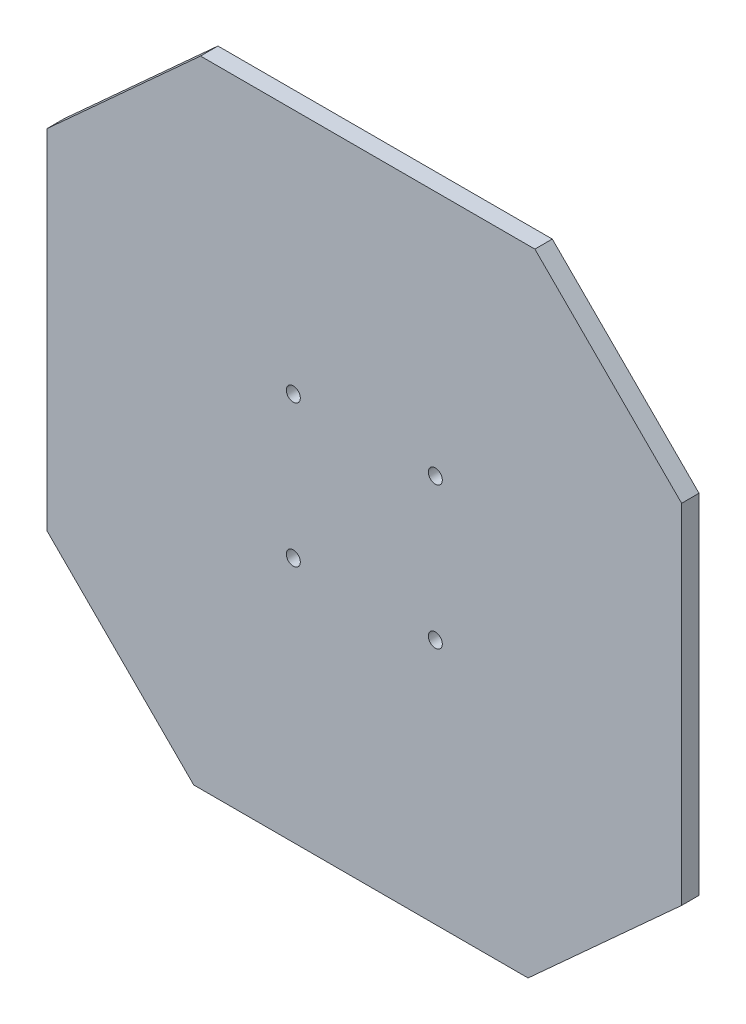
ISO-10303-21;
HEADER;
FILE_DESCRIPTION(('STEP AP214'),'2;1');
FILE_NAME('part.step','',(''),(''),'','','');
FILE_SCHEMA(('AUTOMOTIVE_DESIGN { 1 0 10303 214 1 1 1 1 }'));
ENDSEC;
DATA;
#1=APPLICATION_CONTEXT('core data for automotive mechanical design processes');
#2=APPLICATION_PROTOCOL_DEFINITION('international standard','automotive_design',2000,#1);
#3=PRODUCT_CONTEXT('',#1,'mechanical');
#4=PRODUCT('Part','Part','',(#3));
#5=PRODUCT_RELATED_PRODUCT_CATEGORY('part','',(#4));
#6=PRODUCT_DEFINITION_FORMATION('','',#4);
#7=PRODUCT_DEFINITION_CONTEXT('part definition',#1,'design');
#8=PRODUCT_DEFINITION('design','',#6,#7);
#9=PRODUCT_DEFINITION_SHAPE('','',#8);
#10=(LENGTH_UNIT() NAMED_UNIT(*) SI_UNIT(.MILLI.,.METRE.));
#11=(NAMED_UNIT(*) PLANE_ANGLE_UNIT() SI_UNIT($,.RADIAN.));
#12=(NAMED_UNIT(*) SI_UNIT($,.STERADIAN.) SOLID_ANGLE_UNIT());
#13=UNCERTAINTY_MEASURE_WITH_UNIT(LENGTH_MEASURE(1.E-05),#10,'distance_accuracy_value','');
#14=(GEOMETRIC_REPRESENTATION_CONTEXT(3) GLOBAL_UNCERTAINTY_ASSIGNED_CONTEXT((#13)) GLOBAL_UNIT_ASSIGNED_CONTEXT((#10,
#11,#12)) REPRESENTATION_CONTEXT('',''));
#15=CARTESIAN_POINT('',(0.,0.,0.));
#16=DIRECTION('',(0.,0.,1.));
#17=DIRECTION('',(1.,0.,0.));
#18=AXIS2_PLACEMENT_3D('',#15,#16,#17);
#19=CARTESIAN_POINT('',(92.5410924300891,94.689954591206,2.6));
#20=DIRECTION('',(0.,0.,1.));
#21=DIRECTION('',(1.,0.,0.));
#22=AXIS2_PLACEMENT_3D('',#19,#20,#21);
#23=PLANE('',#22);
#24=CARTESIAN_POINT('',(55.7476941478874,57.8965563090043,2.6));
#25=DIRECTION('',(0.,0.,1.));
#26=DIRECTION('',(1.,0.,0.));
#27=AXIS2_PLACEMENT_3D('',#24,#25,#26);
#28=CIRCLE('',#27,1.05);
#29=CARTESIAN_POINT('',(56.7976941478874,57.8965563090043,2.6));
#30=VERTEX_POINT('',#29);
#31=EDGE_CURVE('E163',#30,#30,#28,.F.);
#32=ORIENTED_EDGE('',*,*,#31,.T.);
#33=EDGE_LOOP('',(#32));
#34=FACE_BOUND('',#33,.T.);
#35=CARTESIAN_POINT('',(34.5344907122909,57.8965563090043,2.6));
#36=DIRECTION('',(0.,0.,1.));
#37=DIRECTION('',(1.,0.,0.));
#38=AXIS2_PLACEMENT_3D('',#35,#36,#37);
#39=CIRCLE('',#38,1.05);
#40=CARTESIAN_POINT('',(35.584490712291,57.8965563090043,2.6));
#41=VERTEX_POINT('',#40);
#42=EDGE_CURVE('E134',#41,#41,#39,.F.);
#43=ORIENTED_EDGE('',*,*,#42,.T.);
#44=EDGE_LOOP('',(#43));
#45=FACE_BOUND('',#44,.T.);
#46=DIRECTION('',(-1.,0.,0.));
#47=VECTOR('',#46,1.);
#48=CARTESIAN_POINT('',(20.6786729232044,94.689954591206,2.6));
#49=LINE('',#48,#47);
#50=CARTESIAN_POINT('',(70.6207822133062,94.689954591206,2.6));
#51=VERTEX_POINT('',#50);
#52=CARTESIAN_POINT('',(20.6786729232044,94.689954591206,2.6));
#53=VERTEX_POINT('',#52);
#54=EDGE_CURVE('E145',#51,#53,#49,.T.);
#55=ORIENTED_EDGE('',*,*,#54,.T.);
#56=DIRECTION('',(-0.739921951390814,-0.672692727662497,0.));
#57=VECTOR('',#56,1.);
#58=CARTESIAN_POINT('',(20.6786729232044,94.689954591206,2.6));
#59=LINE('',#58,#57);
#60=CARTESIAN_POINT('',(-2.25890756991086,73.8364800336686,2.6));
#61=VERTEX_POINT('',#60);
#62=EDGE_CURVE('E93',#53,#61,#59,.T.);
#63=ORIENTED_EDGE('',*,*,#62,.T.);
#64=DIRECTION('',(0.,-1.,0.));
#65=VECTOR('',#64,1.);
#66=CARTESIAN_POINT('',(-2.25890756991086,21.810264807989,2.6));
#67=LINE('',#66,#65);
#68=CARTESIAN_POINT('',(-2.25890756991086,21.810264807989,2.6));
#69=VERTEX_POINT('',#68);
#70=EDGE_CURVE('E183',#61,#69,#67,.T.);
#71=ORIENTED_EDGE('',*,*,#70,.T.);
#72=DIRECTION('',(0.707106781186548,-0.707106781186548,0.));
#73=VECTOR('',#72,1.);
#74=CARTESIAN_POINT('',(-2.25890756991086,21.810264807989,2.6));
#75=LINE('',#74,#73);
#76=CARTESIAN_POINT('',(19.6614026468721,-0.11004540879396,2.6));
#77=VERTEX_POINT('',#76);
#78=EDGE_CURVE('E185',#69,#77,#75,.T.);
#79=ORIENTED_EDGE('',*,*,#78,.T.);
#80=DIRECTION('',(1.,0.,0.));
#81=VECTOR('',#80,1.);
#82=CARTESIAN_POINT('',(19.6614026468721,-0.11004540879396,2.6));
#83=LINE('',#82,#81);
#84=CARTESIAN_POINT('',(69.6035119369739,-0.110045408793957,2.6));
#85=VERTEX_POINT('',#84);
#86=EDGE_CURVE('E112',#77,#85,#83,.T.);
#87=ORIENTED_EDGE('',*,*,#86,.T.);
#88=DIRECTION('',(0.739921951390814,0.672692727662497,0.));
#89=VECTOR('',#88,1.);
#90=CARTESIAN_POINT('',(92.5410924300891,20.7434291487435,2.6));
#91=LINE('',#90,#89);
#92=CARTESIAN_POINT('',(92.5410924300891,20.7434291487435,2.6));
#93=VERTEX_POINT('',#92);
#94=EDGE_CURVE('E106',#85,#93,#91,.T.);
#95=ORIENTED_EDGE('',*,*,#94,.T.);
#96=DIRECTION('',(0.,1.,0.));
#97=VECTOR('',#96,1.);
#98=CARTESIAN_POINT('',(92.5410924300891,20.7434291487435,2.6));
#99=LINE('',#98,#97);
#100=CARTESIAN_POINT('',(92.5410924300891,72.7696443744231,2.6));
#101=VERTEX_POINT('',#100);
#102=EDGE_CURVE('E110',#93,#101,#99,.T.);
#103=ORIENTED_EDGE('',*,*,#102,.T.);
#104=DIRECTION('',(-0.707106781186548,0.707106781186548,0.));
#105=VECTOR('',#104,1.);
#106=CARTESIAN_POINT('',(70.6207822133062,94.689954591206,2.6));
#107=LINE('',#106,#105);
#108=EDGE_CURVE('E50',#101,#51,#107,.T.);
#109=ORIENTED_EDGE('',*,*,#108,.T.);
#110=EDGE_LOOP('',(#55,#63,#71,#79,#87,#95,#103,#109));
#111=FACE_BOUND('',#110,.T.);
#112=CARTESIAN_POINT('',(34.5344907122909,36.6833528734078,2.6));
#113=DIRECTION('',(0.,0.,1.));
#114=DIRECTION('',(1.,0.,0.));
#115=AXIS2_PLACEMENT_3D('',#112,#113,#114);
#116=CIRCLE('',#115,1.05);
#117=CARTESIAN_POINT('',(35.584490712291,36.6833528734078,2.6));
#118=VERTEX_POINT('',#117);
#119=EDGE_CURVE('E160',#118,#118,#116,.F.);
#120=ORIENTED_EDGE('',*,*,#119,.T.);
#121=EDGE_LOOP('',(#120));
#122=FACE_BOUND('',#121,.T.);
#123=CARTESIAN_POINT('',(55.7476941478874,36.6833528734079,2.6));
#124=DIRECTION('',(0.,0.,1.));
#125=DIRECTION('',(1.,0.,0.));
#126=AXIS2_PLACEMENT_3D('',#123,#124,#125);
#127=CIRCLE('',#126,1.05);
#128=CARTESIAN_POINT('',(56.7976941478874,36.6833528734079,2.6));
#129=VERTEX_POINT('',#128);
#130=EDGE_CURVE('E166',#129,#129,#127,.F.);
#131=ORIENTED_EDGE('',*,*,#130,.T.);
#132=EDGE_LOOP('',(#131));
#133=FACE_BOUND('',#132,.T.);
#134=ADVANCED_FACE('F31',(#34,#45,#111,#122,#133),#23,.T.);
#135=CARTESIAN_POINT('',(92.5410924300891,94.689954591206,0.));
#136=DIRECTION('',(0.,0.,1.));
#137=DIRECTION('',(1.,0.,0.));
#138=AXIS2_PLACEMENT_3D('',#135,#136,#137);
#139=PLANE('',#138);
#140=CARTESIAN_POINT('',(55.7476941478874,57.8965563090043,0.));
#141=DIRECTION('',(0.,0.,1.));
#142=DIRECTION('',(1.,0.,0.));
#143=AXIS2_PLACEMENT_3D('',#140,#141,#142);
#144=CIRCLE('',#143,1.05);
#145=CARTESIAN_POINT('',(56.7976941478874,57.8965563090043,0.));
#146=VERTEX_POINT('',#145);
#147=EDGE_CURVE('E164',#146,#146,#144,.F.);
#148=ORIENTED_EDGE('',*,*,#147,.F.);
#149=EDGE_LOOP('',(#148));
#150=FACE_BOUND('',#149,.T.);
#151=CARTESIAN_POINT('',(34.5344907122909,57.8965563090043,0.));
#152=DIRECTION('',(0.,0.,1.));
#153=DIRECTION('',(1.,0.,0.));
#154=AXIS2_PLACEMENT_3D('',#151,#152,#153);
#155=CIRCLE('',#154,1.05);
#156=CARTESIAN_POINT('',(35.584490712291,57.8965563090043,0.));
#157=VERTEX_POINT('',#156);
#158=EDGE_CURVE('E157',#157,#157,#155,.F.);
#159=ORIENTED_EDGE('',*,*,#158,.F.);
#160=EDGE_LOOP('',(#159));
#161=FACE_BOUND('',#160,.T.);
#162=DIRECTION('',(-1.,0.,0.));
#163=VECTOR('',#162,1.);
#164=CARTESIAN_POINT('',(20.6786729232044,94.689954591206,0.));
#165=LINE('',#164,#163);
#166=CARTESIAN_POINT('',(70.6207822133062,94.689954591206,0.));
#167=VERTEX_POINT('',#166);
#168=CARTESIAN_POINT('',(20.6786729232044,94.689954591206,0.));
#169=VERTEX_POINT('',#168);
#170=EDGE_CURVE('E130',#167,#169,#165,.T.);
#171=ORIENTED_EDGE('',*,*,#170,.F.);
#172=DIRECTION('',(-0.707106781186548,0.707106781186548,0.));
#173=VECTOR('',#172,1.);
#174=CARTESIAN_POINT('',(70.6207822133062,94.689954591206,0.));
#175=LINE('',#174,#173);
#176=CARTESIAN_POINT('',(92.5410924300891,72.7696443744231,0.));
#177=VERTEX_POINT('',#176);
#178=EDGE_CURVE('E85',#177,#167,#175,.T.);
#179=ORIENTED_EDGE('',*,*,#178,.F.);
#180=DIRECTION('',(0.,1.,0.));
#181=VECTOR('',#180,1.);
#182=CARTESIAN_POINT('',(92.5410924300891,20.7434291487435,0.));
#183=LINE('',#182,#181);
#184=CARTESIAN_POINT('',(92.5410924300891,20.7434291487435,0.));
#185=VERTEX_POINT('',#184);
#186=EDGE_CURVE('E79',#185,#177,#183,.T.);
#187=ORIENTED_EDGE('',*,*,#186,.F.);
#188=DIRECTION('',(0.739921951390814,0.672692727662497,0.));
#189=VECTOR('',#188,1.);
#190=CARTESIAN_POINT('',(92.5410924300891,20.7434291487435,0.));
#191=LINE('',#190,#189);
#192=CARTESIAN_POINT('',(69.6035119369739,-0.110045408793957,0.));
#193=VERTEX_POINT('',#192);
#194=EDGE_CURVE('E120',#193,#185,#191,.T.);
#195=ORIENTED_EDGE('',*,*,#194,.F.);
#196=DIRECTION('',(1.,0.,0.));
#197=VECTOR('',#196,1.);
#198=CARTESIAN_POINT('',(19.6614026468721,-0.11004540879396,0.));
#199=LINE('',#198,#197);
#200=CARTESIAN_POINT('',(19.6614026468721,-0.11004540879396,0.));
#201=VERTEX_POINT('',#200);
#202=EDGE_CURVE('E140',#201,#193,#199,.T.);
#203=ORIENTED_EDGE('',*,*,#202,.F.);
#204=DIRECTION('',(0.707106781186548,-0.707106781186548,0.));
#205=VECTOR('',#204,1.);
#206=CARTESIAN_POINT('',(-2.25890756991086,21.810264807989,0.));
#207=LINE('',#206,#205);
#208=CARTESIAN_POINT('',(-2.25890756991086,21.810264807989,0.));
#209=VERTEX_POINT('',#208);
#210=EDGE_CURVE('E138',#209,#201,#207,.T.);
#211=ORIENTED_EDGE('',*,*,#210,.F.);
#212=DIRECTION('',(0.,-1.,0.));
#213=VECTOR('',#212,1.);
#214=CARTESIAN_POINT('',(-2.25890756991086,21.810264807989,0.));
#215=LINE('',#214,#213);
#216=CARTESIAN_POINT('',(-2.25890756991086,73.8364800336686,0.));
#217=VERTEX_POINT('',#216);
#218=EDGE_CURVE('E136',#217,#209,#215,.T.);
#219=ORIENTED_EDGE('',*,*,#218,.F.);
#220=DIRECTION('',(-0.739921951390814,-0.672692727662497,0.));
#221=VECTOR('',#220,1.);
#222=CARTESIAN_POINT('',(20.6786729232044,94.689954591206,0.));
#223=LINE('',#222,#221);
#224=EDGE_CURVE('E133',#169,#217,#223,.T.);
#225=ORIENTED_EDGE('',*,*,#224,.F.);
#226=EDGE_LOOP('',(#171,#179,#187,#195,#203,#211,#219,#225));
#227=FACE_BOUND('',#226,.T.);
#228=CARTESIAN_POINT('',(34.5344907122909,36.6833528734078,0.));
#229=DIRECTION('',(0.,0.,1.));
#230=DIRECTION('',(1.,0.,0.));
#231=AXIS2_PLACEMENT_3D('',#228,#229,#230);
#232=CIRCLE('',#231,1.05);
#233=CARTESIAN_POINT('',(35.584490712291,36.6833528734078,0.));
#234=VERTEX_POINT('',#233);
#235=EDGE_CURVE('E161',#234,#234,#232,.F.);
#236=ORIENTED_EDGE('',*,*,#235,.F.);
#237=EDGE_LOOP('',(#236));
#238=FACE_BOUND('',#237,.T.);
#239=CARTESIAN_POINT('',(55.7476941478874,36.6833528734079,0.));
#240=DIRECTION('',(0.,0.,1.));
#241=DIRECTION('',(1.,0.,0.));
#242=AXIS2_PLACEMENT_3D('',#239,#240,#241);
#243=CIRCLE('',#242,1.05);
#244=CARTESIAN_POINT('',(56.7976941478874,36.6833528734079,0.));
#245=VERTEX_POINT('',#244);
#246=EDGE_CURVE('E35',#245,#245,#243,.F.);
#247=ORIENTED_EDGE('',*,*,#246,.F.);
#248=EDGE_LOOP('',(#247));
#249=FACE_BOUND('',#248,.T.);
#250=ADVANCED_FACE('F198',(#150,#161,#227,#238,#249),#139,.F.);
#251=CARTESIAN_POINT('',(20.6786729232044,94.689954591206,2.6));
#252=DIRECTION('',(0.,-1.,0.));
#253=DIRECTION('',(1.,0.,0.));
#254=AXIS2_PLACEMENT_3D('',#251,#252,#253);
#255=PLANE('',#254);
#256=ORIENTED_EDGE('',*,*,#170,.T.);
#257=DIRECTION('',(0.,0.,-1.));
#258=VECTOR('',#257,1.);
#259=CARTESIAN_POINT('',(20.6786729232044,94.689954591206,2.6));
#260=LINE('',#259,#258);
#261=EDGE_CURVE('E11',#53,#169,#260,.T.);
#262=ORIENTED_EDGE('',*,*,#261,.F.);
#263=ORIENTED_EDGE('',*,*,#54,.F.);
#264=DIRECTION('',(0.,0.,-1.));
#265=VECTOR('',#264,1.);
#266=CARTESIAN_POINT('',(70.6207822133062,94.689954591206,2.6));
#267=LINE('',#266,#265);
#268=EDGE_CURVE('E126',#51,#167,#267,.T.);
#269=ORIENTED_EDGE('',*,*,#268,.T.);
#270=EDGE_LOOP('',(#256,#262,#263,#269));
#271=FACE_BOUND('',#270,.T.);
#272=ADVANCED_FACE('F33',(#271),#255,.F.);
#273=CARTESIAN_POINT('',(20.6786729232044,94.689954591206,2.6));
#274=DIRECTION('',(0.672692727662497,-0.739921951390814,0.));
#275=DIRECTION('',(0.739921951390814,0.672692727662497,0.));
#276=AXIS2_PLACEMENT_3D('',#273,#274,#275);
#277=PLANE('',#276);
#278=ORIENTED_EDGE('',*,*,#224,.T.);
#279=DIRECTION('',(0.,0.,-1.));
#280=VECTOR('',#279,1.);
#281=CARTESIAN_POINT('',(-2.25890756991086,73.8364800336686,2.6));
#282=LINE('',#281,#280);
#283=EDGE_CURVE('E41',#61,#217,#282,.T.);
#284=ORIENTED_EDGE('',*,*,#283,.F.);
#285=ORIENTED_EDGE('',*,*,#62,.F.);
#286=ORIENTED_EDGE('',*,*,#261,.T.);
#287=EDGE_LOOP('',(#278,#284,#285,#286));
#288=FACE_BOUND('',#287,.T.);
#289=ADVANCED_FACE('F308',(#288),#277,.F.);
#290=CARTESIAN_POINT('',(-2.25890756991086,21.810264807989,2.6));
#291=DIRECTION('',(1.,0.,0.));
#292=DIRECTION('',(0.,0.,-1.));
#293=AXIS2_PLACEMENT_3D('',#290,#291,#292);
#294=PLANE('',#293);
#295=ORIENTED_EDGE('',*,*,#218,.T.);
#296=DIRECTION('',(0.,0.,-1.));
#297=VECTOR('',#296,1.);
#298=CARTESIAN_POINT('',(-2.25890756991086,21.810264807989,2.6));
#299=LINE('',#298,#297);
#300=EDGE_CURVE('E152',#69,#209,#299,.T.);
#301=ORIENTED_EDGE('',*,*,#300,.F.);
#302=ORIENTED_EDGE('',*,*,#70,.F.);
#303=ORIENTED_EDGE('',*,*,#283,.T.);
#304=EDGE_LOOP('',(#295,#301,#302,#303));
#305=FACE_BOUND('',#304,.T.);
#306=ADVANCED_FACE('F299',(#305),#294,.F.);
#307=CARTESIAN_POINT('',(-2.25890756991086,21.810264807989,2.6));
#308=DIRECTION('',(0.707106781186548,0.707106781186548,0.));
#309=DIRECTION('',(-0.707106781186548,0.707106781186548,0.));
#310=AXIS2_PLACEMENT_3D('',#307,#308,#309);
#311=PLANE('',#310);
#312=ORIENTED_EDGE('',*,*,#210,.T.);
#313=DIRECTION('',(0.,0.,-1.));
#314=VECTOR('',#313,1.);
#315=CARTESIAN_POINT('',(19.6614026468721,-0.11004540879396,2.6));
#316=LINE('',#315,#314);
#317=EDGE_CURVE('E149',#77,#201,#316,.T.);
#318=ORIENTED_EDGE('',*,*,#317,.F.);
#319=ORIENTED_EDGE('',*,*,#78,.F.);
#320=ORIENTED_EDGE('',*,*,#300,.T.);
#321=EDGE_LOOP('',(#312,#318,#319,#320));
#322=FACE_BOUND('',#321,.T.);
#323=ADVANCED_FACE('F191',(#322),#311,.F.);
#324=CARTESIAN_POINT('',(19.6614026468721,-0.11004540879396,2.6));
#325=DIRECTION('',(0.,1.,0.));
#326=DIRECTION('',(-1.,0.,0.));
#327=AXIS2_PLACEMENT_3D('',#324,#325,#326);
#328=PLANE('',#327);
#329=ORIENTED_EDGE('',*,*,#202,.T.);
#330=DIRECTION('',(0.,0.,-1.));
#331=VECTOR('',#330,1.);
#332=CARTESIAN_POINT('',(69.6035119369739,-0.110045408793957,2.6));
#333=LINE('',#332,#331);
#334=EDGE_CURVE('E121',#85,#193,#333,.T.);
#335=ORIENTED_EDGE('',*,*,#334,.F.);
#336=ORIENTED_EDGE('',*,*,#86,.F.);
#337=ORIENTED_EDGE('',*,*,#317,.T.);
#338=EDGE_LOOP('',(#329,#335,#336,#337));
#339=FACE_BOUND('',#338,.T.);
#340=ADVANCED_FACE('F195',(#339),#328,.F.);
#341=CARTESIAN_POINT('',(92.5410924300891,20.7434291487435,2.6));
#342=DIRECTION('',(-0.672692727662497,0.739921951390813,0.));
#343=DIRECTION('',(-0.739921951390813,-0.672692727662497,0.));
#344=AXIS2_PLACEMENT_3D('',#341,#342,#343);
#345=PLANE('',#344);
#346=ORIENTED_EDGE('',*,*,#194,.T.);
#347=DIRECTION('',(0.,0.,-1.));
#348=VECTOR('',#347,1.);
#349=CARTESIAN_POINT('',(92.5410924300891,20.7434291487435,2.6));
#350=LINE('',#349,#348);
#351=EDGE_CURVE('E117',#93,#185,#350,.T.);
#352=ORIENTED_EDGE('',*,*,#351,.F.);
#353=ORIENTED_EDGE('',*,*,#94,.F.);
#354=ORIENTED_EDGE('',*,*,#334,.T.);
#355=EDGE_LOOP('',(#346,#352,#353,#354));
#356=FACE_BOUND('',#355,.T.);
#357=ADVANCED_FACE('F118',(#356),#345,.F.);
#358=CARTESIAN_POINT('',(92.5410924300891,20.7434291487435,2.6));
#359=DIRECTION('',(-1.,0.,0.));
#360=DIRECTION('',(0.,0.,1.));
#361=AXIS2_PLACEMENT_3D('',#358,#359,#360);
#362=PLANE('',#361);
#363=ORIENTED_EDGE('',*,*,#186,.T.);
#364=DIRECTION('',(0.,0.,-1.));
#365=VECTOR('',#364,1.);
#366=CARTESIAN_POINT('',(92.5410924300891,72.7696443744231,2.6));
#367=LINE('',#366,#365);
#368=EDGE_CURVE('E122',#101,#177,#367,.T.);
#369=ORIENTED_EDGE('',*,*,#368,.F.);
#370=ORIENTED_EDGE('',*,*,#102,.F.);
#371=ORIENTED_EDGE('',*,*,#351,.T.);
#372=EDGE_LOOP('',(#363,#369,#370,#371));
#373=FACE_BOUND('',#372,.T.);
#374=ADVANCED_FACE('F124',(#373),#362,.F.);
#375=CARTESIAN_POINT('',(70.6207822133062,94.689954591206,2.6));
#376=DIRECTION('',(-0.707106781186548,-0.707106781186548,0.));
#377=DIRECTION('',(0.707106781186548,-0.707106781186548,0.));
#378=AXIS2_PLACEMENT_3D('',#375,#376,#377);
#379=PLANE('',#378);
#380=ORIENTED_EDGE('',*,*,#178,.T.);
#381=ORIENTED_EDGE('',*,*,#268,.F.);
#382=ORIENTED_EDGE('',*,*,#108,.F.);
#383=ORIENTED_EDGE('',*,*,#368,.T.);
#384=EDGE_LOOP('',(#380,#381,#382,#383));
#385=FACE_BOUND('',#384,.T.);
#386=ADVANCED_FACE('F204',(#385),#379,.F.);
#387=CARTESIAN_POINT('',(34.5344907122909,57.8965563090043,-15.4));
#388=DIRECTION('',(0.,0.,1.));
#389=DIRECTION('',(1.,0.,0.));
#390=AXIS2_PLACEMENT_3D('',#387,#388,#389);
#391=CYLINDRICAL_SURFACE('',#390,1.05);
#392=ORIENTED_EDGE('',*,*,#42,.F.);
#393=EDGE_LOOP('',(#392));
#394=FACE_BOUND('',#393,.T.);
#395=ORIENTED_EDGE('',*,*,#158,.T.);
#396=EDGE_LOOP('',(#395));
#397=FACE_BOUND('',#396,.T.);
#398=ADVANCED_FACE('F206',(#394,#397),#391,.F.);
#399=CARTESIAN_POINT('',(34.5344907122909,36.6833528734078,-15.4));
#400=DIRECTION('',(0.,0.,1.));
#401=DIRECTION('',(0.989337190979773,0.145643134215978,0.));
#402=AXIS2_PLACEMENT_3D('',#399,#400,#401);
#403=CYLINDRICAL_SURFACE('',#402,1.05);
#404=ORIENTED_EDGE('',*,*,#119,.F.);
#405=EDGE_LOOP('',(#404));
#406=FACE_BOUND('',#405,.T.);
#407=ORIENTED_EDGE('',*,*,#235,.T.);
#408=EDGE_LOOP('',(#407));
#409=FACE_BOUND('',#408,.T.);
#410=ADVANCED_FACE('F212',(#406,#409),#403,.F.);
#411=CARTESIAN_POINT('',(55.7476941478874,57.8965563090043,-15.4));
#412=DIRECTION('',(0.,0.,1.));
#413=DIRECTION('',(1.,0.,0.));
#414=AXIS2_PLACEMENT_3D('',#411,#412,#413);
#415=CYLINDRICAL_SURFACE('',#414,1.05);
#416=ORIENTED_EDGE('',*,*,#31,.F.);
#417=EDGE_LOOP('',(#416));
#418=FACE_BOUND('',#417,.T.);
#419=ORIENTED_EDGE('',*,*,#147,.T.);
#420=EDGE_LOOP('',(#419));
#421=FACE_BOUND('',#420,.T.);
#422=ADVANCED_FACE('F228',(#418,#421),#415,.F.);
#423=CARTESIAN_POINT('',(55.7476941478874,36.6833528734079,-15.4));
#424=DIRECTION('',(0.,0.,1.));
#425=DIRECTION('',(1.,0.,0.));
#426=AXIS2_PLACEMENT_3D('',#423,#424,#425);
#427=CYLINDRICAL_SURFACE('',#426,1.05);
#428=ORIENTED_EDGE('',*,*,#130,.F.);
#429=EDGE_LOOP('',(#428));
#430=FACE_BOUND('',#429,.T.);
#431=ORIENTED_EDGE('',*,*,#246,.T.);
#432=EDGE_LOOP('',(#431));
#433=FACE_BOUND('',#432,.T.);
#434=ADVANCED_FACE('F232',(#430,#433),#427,.F.);
#435=CLOSED_SHELL('',(#134,#250,#272,#289,#306,#323,#340,#357,#374,#386,#398,#410,#422,#434));
#436=MANIFOLD_SOLID_BREP('B2',#435);
#437=ADVANCED_BREP_SHAPE_REPRESENTATION('',(#18,#436),#14);
#438=SHAPE_DEFINITION_REPRESENTATION(#9,#437);
ENDSEC;
END-ISO-10303-21;
